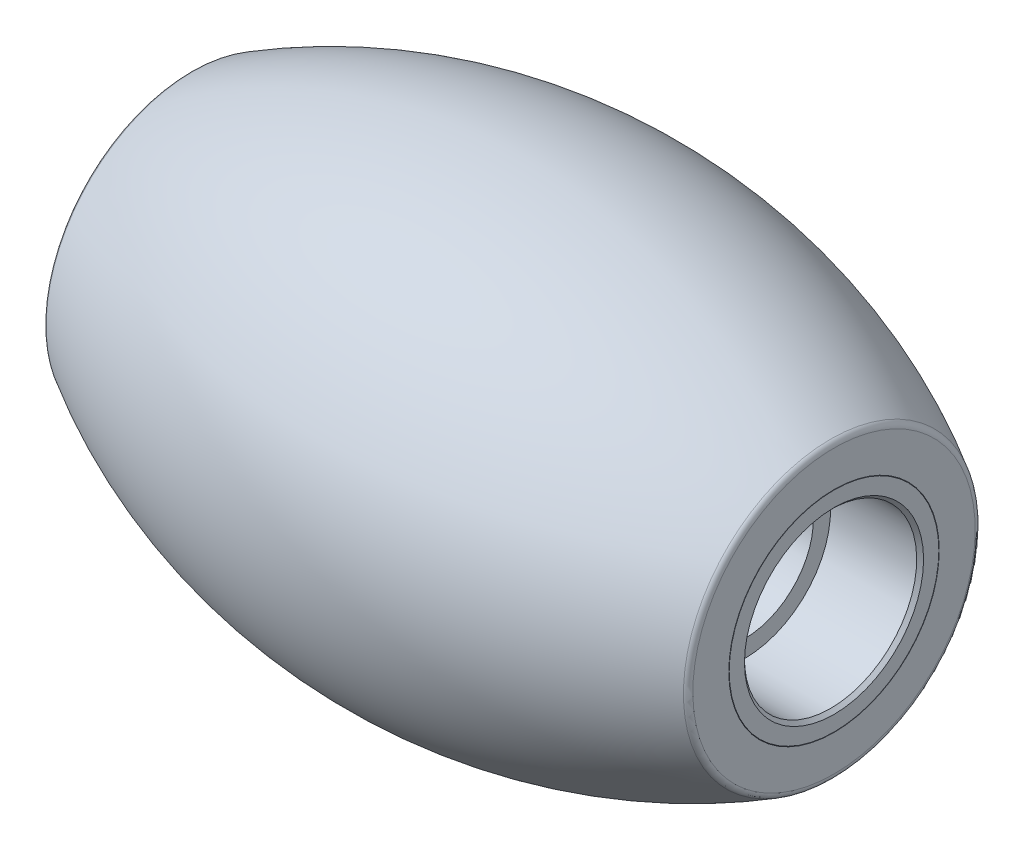
ISO-10303-21;
HEADER;
FILE_DESCRIPTION(('STEP AP214'),'2;1');
FILE_NAME('part.step','',(''),(''),'','','');
FILE_SCHEMA(('AUTOMOTIVE_DESIGN { 1 0 10303 214 1 1 1 1 }'));
ENDSEC;
DATA;
#1=APPLICATION_CONTEXT('core data for automotive mechanical design processes');
#2=APPLICATION_PROTOCOL_DEFINITION('international standard','automotive_design',2000,#1);
#3=PRODUCT_CONTEXT('',#1,'mechanical');
#4=PRODUCT('Part','Part','',(#3));
#5=PRODUCT_RELATED_PRODUCT_CATEGORY('part','',(#4));
#6=PRODUCT_DEFINITION_FORMATION('','',#4);
#7=PRODUCT_DEFINITION_CONTEXT('part definition',#1,'design');
#8=PRODUCT_DEFINITION('design','',#6,#7);
#9=PRODUCT_DEFINITION_SHAPE('','',#8);
#10=(LENGTH_UNIT() NAMED_UNIT(*) SI_UNIT(.MILLI.,.METRE.));
#11=(NAMED_UNIT(*) PLANE_ANGLE_UNIT() SI_UNIT($,.RADIAN.));
#12=(NAMED_UNIT(*) SI_UNIT($,.STERADIAN.) SOLID_ANGLE_UNIT());
#13=UNCERTAINTY_MEASURE_WITH_UNIT(LENGTH_MEASURE(1.E-05),#10,'distance_accuracy_value','');
#14=(GEOMETRIC_REPRESENTATION_CONTEXT(3) GLOBAL_UNCERTAINTY_ASSIGNED_CONTEXT((#13)) GLOBAL_UNIT_ASSIGNED_CONTEXT((#10,
#11,#12)) REPRESENTATION_CONTEXT('',''));
#15=CARTESIAN_POINT('',(0.,0.,0.));
#16=DIRECTION('',(0.,0.,1.));
#17=DIRECTION('',(1.,0.,0.));
#18=AXIS2_PLACEMENT_3D('',#15,#16,#17);
#19=CARTESIAN_POINT('',(0.,0.,0.));
#20=DIRECTION('',(-1.,0.,0.));
#21=DIRECTION('',(0.,-1.,0.));
#22=AXIS2_PLACEMENT_3D('',#19,#20,#21);
#23=DEGENERATE_TOROIDAL_SURFACE('',#22,11.75,17.51,.F.);
#24=CARTESIAN_POINT('',(9.35,0.,0.));
#25=DIRECTION('',(-1.,0.,0.));
#26=DIRECTION('',(0.,-1.,0.));
#27=AXIS2_PLACEMENT_3D('',#24,#25,#26);
#28=CIRCLE('',#27,3.05464791881252);
#29=CARTESIAN_POINT('',(9.35,-3.05464791881252,0.));
#30=VERTEX_POINT('',#29);
#31=EDGE_CURVE('E61',#30,#30,#28,.T.);
#32=ORIENTED_EDGE('',*,*,#31,.F.);
#33=EDGE_LOOP('',(#32));
#34=FACE_BOUND('',#33,.T.);
#35=CARTESIAN_POINT('',(-9.35,0.,0.));
#36=DIRECTION('',(-1.,0.,0.));
#37=DIRECTION('',(0.,-1.,0.));
#38=AXIS2_PLACEMENT_3D('',#35,#36,#37);
#39=CIRCLE('',#38,3.05464791881252);
#40=CARTESIAN_POINT('',(-9.35,-3.05464791881252,0.));
#41=VERTEX_POINT('',#40);
#42=EDGE_CURVE('E64',#41,#41,#39,.T.);
#43=ORIENTED_EDGE('',*,*,#42,.T.);
#44=EDGE_LOOP('',(#43));
#45=FACE_BOUND('',#44,.T.);
#46=ADVANCED_FACE('F41',(#34,#45),#23,.T.);
#47=CARTESIAN_POINT('',(9.35,3.05464791881252,0.));
#48=DIRECTION('',(-1.,0.,0.));
#49=DIRECTION('',(0.,-1.,0.));
#50=AXIS2_PLACEMENT_3D('',#47,#48,#49);
#51=PLANE('',#50);
#52=CARTESIAN_POINT('',(9.35,0.,0.));
#53=DIRECTION('',(-1.,0.,0.));
#54=DIRECTION('',(0.,-1.,0.));
#55=AXIS2_PLACEMENT_3D('',#52,#53,#54);
#56=CIRCLE('',#55,4.09826488925523);
#57=CARTESIAN_POINT('',(9.35,-4.09826488925522,0.));
#58=VERTEX_POINT('',#57);
#59=EDGE_CURVE('E11',#58,#58,#56,.F.);
#60=ORIENTED_EDGE('',*,*,#59,.T.);
#61=EDGE_LOOP('',(#60));
#62=FACE_BOUND('',#61,.T.);
#63=ORIENTED_EDGE('',*,*,#31,.T.);
#64=EDGE_LOOP('',(#63));
#65=FACE_BOUND('',#64,.T.);
#66=ADVANCED_FACE('F80',(#62,#65),#51,.F.);
#67=CARTESIAN_POINT('',(0.,0.,0.));
#68=DIRECTION('',(-1.,0.,0.));
#69=DIRECTION('',(0.,-1.,0.));
#70=AXIS2_PLACEMENT_3D('',#67,#68,#69);
#71=DEGENERATE_TOROIDAL_SURFACE('',#70,11.75,18.5,.F.);
#72=CARTESIAN_POINT('',(-9.25,0.,0.));
#73=DIRECTION('',(1.,0.,0.));
#74=DIRECTION('',(0.,1.,0.));
#75=AXIS2_PLACEMENT_3D('',#72,#73,#74);
#76=CIRCLE('',#75,4.27146997001212);
#77=CARTESIAN_POINT('',(-9.25,4.27146997001212,0.));
#78=VERTEX_POINT('',#77);
#79=EDGE_CURVE('E48',#78,#78,#76,.T.);
#80=ORIENTED_EDGE('',*,*,#79,.T.);
#81=EDGE_LOOP('',(#80));
#82=FACE_BOUND('',#81,.T.);
#83=CARTESIAN_POINT('',(9.25,0.,0.));
#84=DIRECTION('',(-1.,0.,0.));
#85=DIRECTION('',(0.,-1.,0.));
#86=AXIS2_PLACEMENT_3D('',#83,#84,#85);
#87=CIRCLE('',#86,4.27146997001211);
#88=CARTESIAN_POINT('',(9.25,-4.27146997001211,0.));
#89=VERTEX_POINT('',#88);
#90=EDGE_CURVE('E52',#89,#89,#87,.T.);
#91=ORIENTED_EDGE('',*,*,#90,.T.);
#92=EDGE_LOOP('',(#91));
#93=FACE_BOUND('',#92,.T.);
#94=ADVANCED_FACE('F72',(#82,#93),#71,.F.);
#95=CARTESIAN_POINT('',(-9.35,3.05464791881252,0.));
#96=DIRECTION('',(1.,0.,0.));
#97=DIRECTION('',(0.,1.,0.));
#98=AXIS2_PLACEMENT_3D('',#95,#96,#97);
#99=PLANE('',#98);
#100=CARTESIAN_POINT('',(-9.35,0.,0.));
#101=DIRECTION('',(1.,0.,0.));
#102=DIRECTION('',(0.,1.,0.));
#103=AXIS2_PLACEMENT_3D('',#100,#101,#102);
#104=CIRCLE('',#103,4.09826488925523);
#105=CARTESIAN_POINT('',(-9.35,4.09826488925523,0.));
#106=VERTEX_POINT('',#105);
#107=EDGE_CURVE('E56',#106,#106,#104,.F.);
#108=ORIENTED_EDGE('',*,*,#107,.T.);
#109=EDGE_LOOP('',(#108));
#110=FACE_BOUND('',#109,.T.);
#111=ORIENTED_EDGE('',*,*,#42,.F.);
#112=EDGE_LOOP('',(#111));
#113=FACE_BOUND('',#112,.T.);
#114=ADVANCED_FACE('F69',(#110,#113),#99,.F.);
#115=CARTESIAN_POINT('',(-9.15,0.,0.));
#116=DIRECTION('',(1.,0.,0.));
#117=DIRECTION('',(0.,1.,0.));
#118=AXIS2_PLACEMENT_3D('',#115,#116,#117);
#119=TOROIDAL_SURFACE('',#118,4.09826488925523,0.2);
#120=ORIENTED_EDGE('',*,*,#79,.F.);
#121=EDGE_LOOP('',(#120));
#122=FACE_BOUND('',#121,.T.);
#123=ORIENTED_EDGE('',*,*,#107,.F.);
#124=EDGE_LOOP('',(#123));
#125=FACE_BOUND('',#124,.T.);
#126=ADVANCED_FACE('F71',(#122,#125),#119,.T.);
#127=CARTESIAN_POINT('',(9.15,0.,0.));
#128=DIRECTION('',(-1.,0.,0.));
#129=DIRECTION('',(0.,-1.,0.));
#130=AXIS2_PLACEMENT_3D('',#127,#128,#129);
#131=TOROIDAL_SURFACE('',#130,4.09826488925523,0.2);
#132=ORIENTED_EDGE('',*,*,#59,.F.);
#133=EDGE_LOOP('',(#132));
#134=FACE_BOUND('',#133,.T.);
#135=ORIENTED_EDGE('',*,*,#90,.F.);
#136=EDGE_LOOP('',(#135));
#137=FACE_BOUND('',#136,.T.);
#138=ADVANCED_FACE('F43',(#134,#137),#131,.T.);
#139=CLOSED_SHELL('',(#46,#66,#94,#114,#126,#138));
#140=MANIFOLD_SOLID_BREP('B2',#139);
#141=CARTESIAN_POINT('',(-9.35,3.04281920392459,0.));
#142=DIRECTION('',(1.,0.,0.));
#143=DIRECTION('',(0.,1.,0.));
#144=AXIS2_PLACEMENT_3D('',#141,#142,#143);
#145=PLANE('',#144);
#146=CARTESIAN_POINT('',(-9.35,0.,0.));
#147=DIRECTION('',(1.,0.,0.));
#148=DIRECTION('',(0.,1.,0.));
#149=AXIS2_PLACEMENT_3D('',#146,#147,#148);
#150=CIRCLE('',#149,2.6);
#151=CARTESIAN_POINT('',(-9.35,2.6,0.));
#152=VERTEX_POINT('',#151);
#153=EDGE_CURVE('E144',#152,#152,#150,.T.);
#154=ORIENTED_EDGE('',*,*,#153,.T.);
#155=EDGE_LOOP('',(#154));
#156=FACE_BOUND('',#155,.T.);
#157=CARTESIAN_POINT('',(-9.35,0.,0.));
#158=DIRECTION('',(-1.,0.,0.));
#159=DIRECTION('',(0.,-1.,0.));
#160=AXIS2_PLACEMENT_3D('',#157,#158,#159);
#161=CIRCLE('',#160,3.04281920392459);
#162=CARTESIAN_POINT('',(-9.35,-3.04281920392459,0.));
#163=VERTEX_POINT('',#162);
#164=EDGE_CURVE('E153',#163,#163,#161,.T.);
#165=ORIENTED_EDGE('',*,*,#164,.T.);
#166=EDGE_LOOP('',(#165));
#167=FACE_BOUND('',#166,.T.);
#168=ADVANCED_FACE('F133',(#156,#167),#145,.F.);
#169=CARTESIAN_POINT('',(9.35,0.,0.));
#170=DIRECTION('',(-1.,0.,0.));
#171=DIRECTION('',(0.,-1.,0.));
#172=AXIS2_PLACEMENT_3D('',#169,#170,#171);
#173=PLANE('',#172);
#174=CARTESIAN_POINT('',(9.35,0.,0.));
#175=DIRECTION('',(-1.,0.,0.));
#176=DIRECTION('',(0.,-1.,0.));
#177=AXIS2_PLACEMENT_3D('',#174,#175,#176);
#178=CIRCLE('',#177,2.6);
#179=CARTESIAN_POINT('',(9.35,-2.59999999999999,0.));
#180=VERTEX_POINT('',#179);
#181=EDGE_CURVE('E140',#180,#180,#178,.T.);
#182=ORIENTED_EDGE('',*,*,#181,.T.);
#183=EDGE_LOOP('',(#182));
#184=FACE_BOUND('',#183,.T.);
#185=CARTESIAN_POINT('',(9.35,0.,0.));
#186=DIRECTION('',(-1.,0.,0.));
#187=DIRECTION('',(0.,-1.,0.));
#188=AXIS2_PLACEMENT_3D('',#185,#186,#187);
#189=CIRCLE('',#188,3.04281920392458);
#190=CARTESIAN_POINT('',(9.35,-3.04281920392458,0.));
#191=VERTEX_POINT('',#190);
#192=EDGE_CURVE('E156',#191,#191,#189,.T.);
#193=ORIENTED_EDGE('',*,*,#192,.F.);
#194=EDGE_LOOP('',(#193));
#195=FACE_BOUND('',#194,.T.);
#196=ADVANCED_FACE('F188',(#184,#195),#173,.F.);
#197=CARTESIAN_POINT('',(0.,0.,0.));
#198=DIRECTION('',(-1.,0.,0.));
#199=DIRECTION('',(0.,-1.,0.));
#200=AXIS2_PLACEMENT_3D('',#197,#198,#199);
#201=DEGENERATE_TOROIDAL_SURFACE('',#200,11.75,17.5,.F.);
#202=ORIENTED_EDGE('',*,*,#164,.F.);
#203=EDGE_LOOP('',(#202));
#204=FACE_BOUND('',#203,.T.);
#205=ORIENTED_EDGE('',*,*,#192,.T.);
#206=EDGE_LOOP('',(#205));
#207=FACE_BOUND('',#206,.T.);
#208=ADVANCED_FACE('F194',(#204,#207),#201,.F.);
#209=CARTESIAN_POINT('',(-9.35,0.,0.));
#210=DIRECTION('',(-1.,0.,0.));
#211=DIRECTION('',(0.,-1.,0.));
#212=AXIS2_PLACEMENT_3D('',#209,#210,#211);
#213=CYLINDRICAL_SURFACE('',#212,2.5);
#214=CARTESIAN_POINT('',(9.25,0.,0.));
#215=DIRECTION('',(-1.,0.,0.));
#216=DIRECTION('',(0.,-1.,0.));
#217=AXIS2_PLACEMENT_3D('',#214,#215,#216);
#218=CIRCLE('',#217,2.5);
#219=CARTESIAN_POINT('',(9.25,-2.49999999999999,0.));
#220=VERTEX_POINT('',#219);
#221=EDGE_CURVE('E40',#220,#220,#218,.F.);
#222=ORIENTED_EDGE('',*,*,#221,.T.);
#223=EDGE_LOOP('',(#222));
#224=FACE_BOUND('',#223,.T.);
#225=CARTESIAN_POINT('',(6.75,0.,0.));
#226=DIRECTION('',(-1.,0.,0.));
#227=DIRECTION('',(0.,-1.,0.));
#228=AXIS2_PLACEMENT_3D('',#225,#226,#227);
#229=CIRCLE('',#228,2.5);
#230=CARTESIAN_POINT('',(6.75,-2.49999999999999,0.));
#231=VERTEX_POINT('',#230);
#232=EDGE_CURVE('E159',#231,#231,#229,.T.);
#233=ORIENTED_EDGE('',*,*,#232,.T.);
#234=EDGE_LOOP('',(#233));
#235=FACE_BOUND('',#234,.T.);
#236=ADVANCED_FACE('F199',(#224,#235),#213,.F.);
#237=CARTESIAN_POINT('',(6.75,2.,0.));
#238=DIRECTION('',(1.,0.,0.));
#239=DIRECTION('',(0.,1.,0.));
#240=AXIS2_PLACEMENT_3D('',#237,#238,#239);
#241=PLANE('',#240);
#242=CARTESIAN_POINT('',(6.75,0.,0.));
#243=DIRECTION('',(-1.,0.,0.));
#244=DIRECTION('',(0.,-1.,0.));
#245=AXIS2_PLACEMENT_3D('',#242,#243,#244);
#246=CIRCLE('',#245,2.);
#247=CARTESIAN_POINT('',(6.75,-1.99999999999999,0.));
#248=VERTEX_POINT('',#247);
#249=EDGE_CURVE('E162',#248,#248,#246,.T.);
#250=ORIENTED_EDGE('',*,*,#249,.T.);
#251=EDGE_LOOP('',(#250));
#252=FACE_BOUND('',#251,.T.);
#253=ORIENTED_EDGE('',*,*,#232,.F.);
#254=EDGE_LOOP('',(#253));
#255=FACE_BOUND('',#254,.T.);
#256=ADVANCED_FACE('F204',(#252,#255),#241,.T.);
#257=CARTESIAN_POINT('',(-9.35,0.,0.));
#258=DIRECTION('',(-1.,0.,0.));
#259=DIRECTION('',(0.,-1.,0.));
#260=AXIS2_PLACEMENT_3D('',#257,#258,#259);
#261=CYLINDRICAL_SURFACE('',#260,2.);
#262=CARTESIAN_POINT('',(-6.75,0.,0.));
#263=DIRECTION('',(-1.,0.,0.));
#264=DIRECTION('',(0.,-1.,0.));
#265=AXIS2_PLACEMENT_3D('',#262,#263,#264);
#266=CIRCLE('',#265,2.);
#267=CARTESIAN_POINT('',(-6.75,-2.,0.));
#268=VERTEX_POINT('',#267);
#269=EDGE_CURVE('E165',#268,#268,#266,.T.);
#270=ORIENTED_EDGE('',*,*,#269,.T.);
#271=EDGE_LOOP('',(#270));
#272=FACE_BOUND('',#271,.T.);
#273=ORIENTED_EDGE('',*,*,#249,.F.);
#274=EDGE_LOOP('',(#273));
#275=FACE_BOUND('',#274,.T.);
#276=ADVANCED_FACE('F185',(#272,#275),#261,.F.);
#277=CARTESIAN_POINT('',(-6.75,2.5,0.));
#278=DIRECTION('',(-1.,0.,0.));
#279=DIRECTION('',(0.,-1.,0.));
#280=AXIS2_PLACEMENT_3D('',#277,#278,#279);
#281=PLANE('',#280);
#282=CARTESIAN_POINT('',(-6.75,0.,0.));
#283=DIRECTION('',(-1.,0.,0.));
#284=DIRECTION('',(0.,-1.,0.));
#285=AXIS2_PLACEMENT_3D('',#282,#283,#284);
#286=CIRCLE('',#285,2.5);
#287=CARTESIAN_POINT('',(-6.75,-2.5,0.));
#288=VERTEX_POINT('',#287);
#289=EDGE_CURVE('E168',#288,#288,#286,.T.);
#290=ORIENTED_EDGE('',*,*,#289,.T.);
#291=EDGE_LOOP('',(#290));
#292=FACE_BOUND('',#291,.T.);
#293=ORIENTED_EDGE('',*,*,#269,.F.);
#294=EDGE_LOOP('',(#293));
#295=FACE_BOUND('',#294,.T.);
#296=ADVANCED_FACE('F172',(#292,#295),#281,.T.);
#297=CARTESIAN_POINT('',(-9.35,0.,0.));
#298=DIRECTION('',(-1.,0.,0.));
#299=DIRECTION('',(0.,-1.,0.));
#300=AXIS2_PLACEMENT_3D('',#297,#298,#299);
#301=CYLINDRICAL_SURFACE('',#300,2.5);
#302=CARTESIAN_POINT('',(-9.25,0.,0.));
#303=DIRECTION('',(1.,0.,0.));
#304=DIRECTION('',(0.,1.,0.));
#305=AXIS2_PLACEMENT_3D('',#302,#303,#304);
#306=CIRCLE('',#305,2.5);
#307=CARTESIAN_POINT('',(-9.25,2.5,0.));
#308=VERTEX_POINT('',#307);
#309=EDGE_CURVE('E148',#308,#308,#306,.F.);
#310=ORIENTED_EDGE('',*,*,#309,.T.);
#311=EDGE_LOOP('',(#310));
#312=FACE_BOUND('',#311,.T.);
#313=ORIENTED_EDGE('',*,*,#289,.F.);
#314=EDGE_LOOP('',(#313));
#315=FACE_BOUND('',#314,.T.);
#316=ADVANCED_FACE('F175',(#312,#315),#301,.F.);
#317=CARTESIAN_POINT('',(-9.25,0.,0.));
#318=DIRECTION('',(-1.,0.,0.));
#319=DIRECTION('',(0.,-1.,0.));
#320=AXIS2_PLACEMENT_3D('',#317,#318,#319);
#321=CONICAL_SURFACE('',#320,2.5,0.785398163397455);
#322=ORIENTED_EDGE('',*,*,#153,.F.);
#323=EDGE_LOOP('',(#322));
#324=FACE_BOUND('',#323,.T.);
#325=ORIENTED_EDGE('',*,*,#309,.F.);
#326=EDGE_LOOP('',(#325));
#327=FACE_BOUND('',#326,.T.);
#328=ADVANCED_FACE('F177',(#324,#327),#321,.F.);
#329=CARTESIAN_POINT('',(9.35,0.,0.));
#330=DIRECTION('',(1.,0.,0.));
#331=DIRECTION('',(0.,1.,0.));
#332=AXIS2_PLACEMENT_3D('',#329,#330,#331);
#333=CONICAL_SURFACE('',#332,2.6,0.785398163397446);
#334=ORIENTED_EDGE('',*,*,#221,.F.);
#335=EDGE_LOOP('',(#334));
#336=FACE_BOUND('',#335,.T.);
#337=ORIENTED_EDGE('',*,*,#181,.F.);
#338=EDGE_LOOP('',(#337));
#339=FACE_BOUND('',#338,.T.);
#340=ADVANCED_FACE('F135',(#336,#339),#333,.F.);
#341=CLOSED_SHELL('',(#168,#196,#208,#236,#256,#276,#296,#316,#328,#340));
#342=MANIFOLD_SOLID_BREP('B6',#341);
#343=ADVANCED_BREP_SHAPE_REPRESENTATION('',(#18,#140,#342),#14);
#344=SHAPE_DEFINITION_REPRESENTATION(#9,#343);
ENDSEC;
END-ISO-10303-21;
